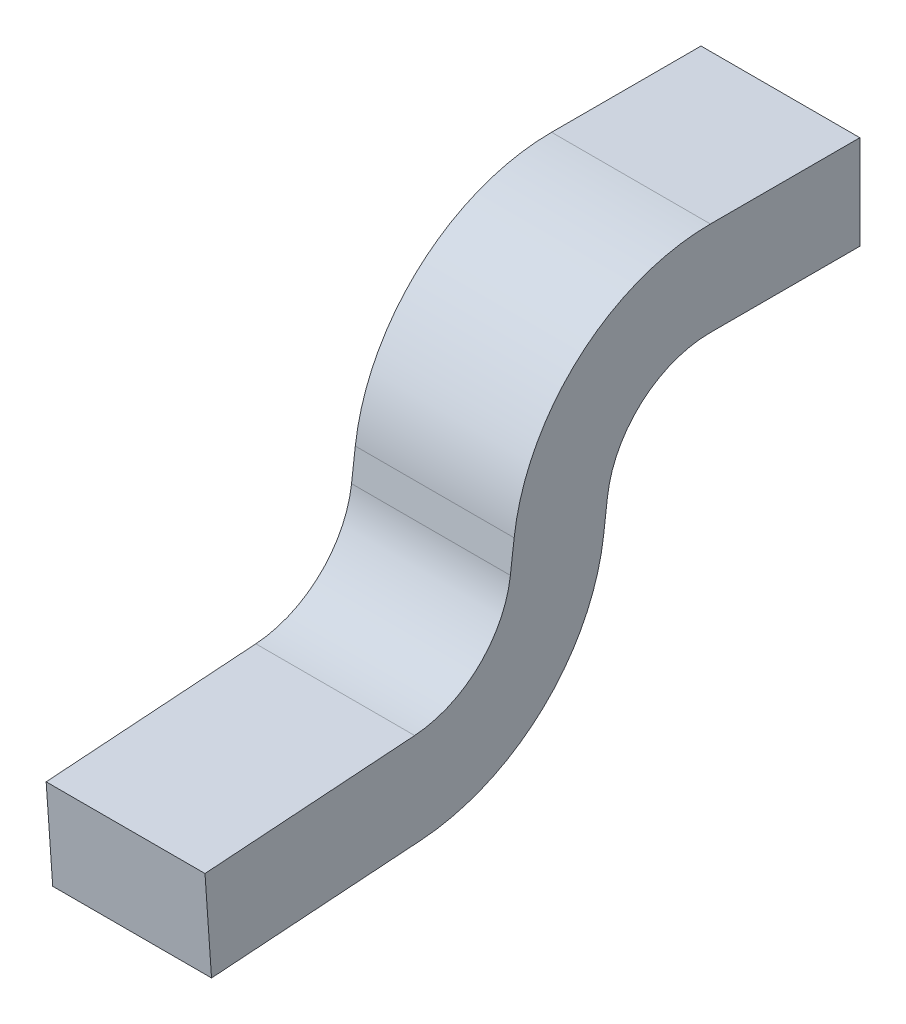
ISO-10303-21;
HEADER;
FILE_DESCRIPTION(('STEP AP214'),'2;1');
FILE_NAME('part.step','',(''),(''),'','','');
FILE_SCHEMA(('AUTOMOTIVE_DESIGN { 1 0 10303 214 1 1 1 1 }'));
ENDSEC;
DATA;
#1=APPLICATION_CONTEXT('core data for automotive mechanical design processes');
#2=APPLICATION_PROTOCOL_DEFINITION('international standard','automotive_design',2000,#1);
#3=PRODUCT_CONTEXT('',#1,'mechanical');
#4=PRODUCT('Part','Part','',(#3));
#5=PRODUCT_RELATED_PRODUCT_CATEGORY('part','',(#4));
#6=PRODUCT_DEFINITION_FORMATION('','',#4);
#7=PRODUCT_DEFINITION_CONTEXT('part definition',#1,'design');
#8=PRODUCT_DEFINITION('design','',#6,#7);
#9=PRODUCT_DEFINITION_SHAPE('','',#8);
#10=(LENGTH_UNIT() NAMED_UNIT(*) SI_UNIT(.MILLI.,.METRE.));
#11=(NAMED_UNIT(*) PLANE_ANGLE_UNIT() SI_UNIT($,.RADIAN.));
#12=(NAMED_UNIT(*) SI_UNIT($,.STERADIAN.) SOLID_ANGLE_UNIT());
#13=UNCERTAINTY_MEASURE_WITH_UNIT(LENGTH_MEASURE(1.E-05),#10,'distance_accuracy_value','');
#14=(GEOMETRIC_REPRESENTATION_CONTEXT(3) GLOBAL_UNCERTAINTY_ASSIGNED_CONTEXT((#13)) GLOBAL_UNIT_ASSIGNED_CONTEXT((#10,
#11,#12)) REPRESENTATION_CONTEXT('',''));
#15=CARTESIAN_POINT('',(0.,0.,0.));
#16=DIRECTION('',(0.,0.,1.));
#17=DIRECTION('',(1.,0.,0.));
#18=AXIS2_PLACEMENT_3D('',#15,#16,#17);
#19=CARTESIAN_POINT('',(0.1225,0.,0.));
#20=DIRECTION('',(1.,0.,0.));
#21=DIRECTION('',(0.,0.,-1.));
#22=AXIS2_PLACEMENT_3D('',#19,#20,#21);
#23=PLANE('',#22);
#24=CARTESIAN_POINT('',(0.1225,0.0675,-0.169489529934));
#25=DIRECTION('',(-1.,0.,0.));
#26=DIRECTION('',(0.,0.,1.));
#27=AXIS2_PLACEMENT_3D('',#24,#25,#26);
#28=CIRCLE('',#27,0.305);
#29=CARTESIAN_POINT('',(0.1225,0.104670149738761,0.133237046316236));
#30=VERTEX_POINT('',#29);
#31=CARTESIAN_POINT('',(0.1225,0.3725,-0.169489529934));
#32=VERTEX_POINT('',#31);
#33=EDGE_CURVE('E196',#30,#32,#28,.T.);
#34=ORIENTED_EDGE('',*,*,#33,.F.);
#35=DIRECTION('',(0.,-0.992546151641335,0.121869343405041));
#36=VECTOR('',#35,1.);
#37=CARTESIAN_POINT('',(0.1225,0.01767105479375,0.143919191988));
#38=LINE('',#37,#36);
#39=CARTESIAN_POINT('',(0.1225,0.0573739531898189,0.139044289042129));
#40=VERTEX_POINT('',#39);
#41=EDGE_CURVE('E193',#40,#30,#38,.F.);
#42=ORIENTED_EDGE('',*,*,#41,.F.);
#43=CARTESIAN_POINT('',(0.1225,0.07687304813464,0.297851673305));
#44=DIRECTION('',(1.,0.,0.));
#45=DIRECTION('',(0.,0.,-1.));
#46=AXIS2_PLACEMENT_3D('',#43,#44,#45);
#47=CIRCLE('',#46,0.16);
#48=CARTESIAN_POINT('',(0.1225,-0.082737199906957,0.286690637505469));
#49=VERTEX_POINT('',#48);
#50=EDGE_CURVE('E190',#40,#49,#47,.F.);
#51=ORIENTED_EDGE('',*,*,#50,.T.);
#52=DIRECTION('',(0.,-0.0697564737441177,0.997564050259825));
#53=VECTOR('',#52,1.);
#54=CARTESIAN_POINT('',(0.1225,-0.07353675199435,0.155118102495));
#55=LINE('',#54,#53);
#56=CARTESIAN_POINT('',(0.1225,-0.105353212712117,0.610114688692992));
#57=VERTEX_POINT('',#56);
#58=EDGE_CURVE('E186',#57,#49,#55,.F.);
#59=ORIENTED_EDGE('',*,*,#58,.F.);
#60=DIRECTION('',(0.,-0.997564050259825,-0.0697564737441078));
#61=VECTOR('',#60,1.);
#62=CARTESIAN_POINT('',(0.1225,-0.105353212712,0.610114688693));
#63=LINE('',#62,#61);
#64=CARTESIAN_POINT('',(0.1225,-0.250000000000002,0.600000000000027));
#65=VERTEX_POINT('',#64);
#66=EDGE_CURVE('E126',#65,#57,#63,.F.);
#67=ORIENTED_EDGE('',*,*,#66,.F.);
#68=DIRECTION('',(0.,0.0697564737441177,-0.997564050259825));
#69=VECTOR('',#68,1.);
#70=CARTESIAN_POINT('',(0.1225,-0.25,0.6));
#71=LINE('',#70,#69);
#72=CARTESIAN_POINT('',(0.1225,-0.227383987194625,0.276575948813034));
#73=VERTEX_POINT('',#72);
#74=EDGE_CURVE('E130',#73,#65,#71,.F.);
#75=ORIENTED_EDGE('',*,*,#74,.F.);
#76=CARTESIAN_POINT('',(0.1225,0.07687304813464,0.297851673305));
#77=DIRECTION('',(-1.,0.,0.));
#78=DIRECTION('',(0.,0.,1.));
#79=AXIS2_PLACEMENT_3D('',#76,#77,#78);
#80=CIRCLE('',#79,0.305);
#81=CARTESIAN_POINT('',(0.1225,0.0397028983960895,-0.00487490294584365));
#82=VERTEX_POINT('',#81);
#83=EDGE_CURVE('E174',#82,#73,#80,.T.);
#84=ORIENTED_EDGE('',*,*,#83,.F.);
#85=DIRECTION('',(0.,0.992546151641335,-0.121869343405041));
#86=VECTOR('',#85,1.);
#87=CARTESIAN_POINT('',(0.1225,-0.209845633361,0.02576580394965));
#88=LINE('',#87,#86);
#89=CARTESIAN_POINT('',(0.1225,0.0869990949448169,-0.0106821456715386));
#90=VERTEX_POINT('',#89);
#91=EDGE_CURVE('E90',#90,#82,#88,.F.);
#92=ORIENTED_EDGE('',*,*,#91,.F.);
#93=CARTESIAN_POINT('',(0.1225,0.0675,-0.169489529934));
#94=DIRECTION('',(1.,0.,0.));
#95=DIRECTION('',(0.,0.,-1.));
#96=AXIS2_PLACEMENT_3D('',#93,#94,#95);
#97=CIRCLE('',#96,0.16);
#98=CARTESIAN_POINT('',(0.1225,0.2275,-0.169489529934));
#99=VERTEX_POINT('',#98);
#100=EDGE_CURVE('E20',#90,#99,#97,.F.);
#101=ORIENTED_EDGE('',*,*,#100,.T.);
#102=DIRECTION('',(0.,0.,-1.));
#103=VECTOR('',#102,1.);
#104=CARTESIAN_POINT('',(0.1225,0.2275,-0.02793348760541));
#105=LINE('',#104,#103);
#106=CARTESIAN_POINT('',(0.1225,0.2275,-0.4));
#107=VERTEX_POINT('',#106);
#108=EDGE_CURVE('E96',#107,#99,#105,.F.);
#109=ORIENTED_EDGE('',*,*,#108,.F.);
#110=DIRECTION('',(0.,1.,0.));
#111=VECTOR('',#110,1.);
#112=CARTESIAN_POINT('',(0.1225,0.2275,-0.4));
#113=LINE('',#112,#111);
#114=CARTESIAN_POINT('',(0.1225,0.3725,-0.4));
#115=VERTEX_POINT('',#114);
#116=EDGE_CURVE('E102',#115,#107,#113,.F.);
#117=ORIENTED_EDGE('',*,*,#116,.F.);
#118=DIRECTION('',(0.,0.,1.));
#119=VECTOR('',#118,1.);
#120=CARTESIAN_POINT('',(0.1225,0.3725,-0.4));
#121=LINE('',#120,#119);
#122=EDGE_CURVE('E108',#32,#115,#121,.F.);
#123=ORIENTED_EDGE('',*,*,#122,.F.);
#124=EDGE_LOOP('',(#34,#42,#51,#59,#67,#75,#84,#92,#101,#109,#117,#123));
#125=FACE_BOUND('',#124,.T.);
#126=ADVANCED_FACE('F17',(#125),#23,.T.);
#127=CARTESIAN_POINT('',(-0.1225,-0.209845633361,0.02576580394965));
#128=DIRECTION('',(0.,-0.121869343405041,-0.992546151641335));
#129=DIRECTION('',(0.,0.992546151641335,-0.121869343405041));
#130=AXIS2_PLACEMENT_3D('',#127,#128,#129);
#131=PLANE('',#130);
#132=DIRECTION('',(1.,0.,0.));
#133=VECTOR('',#132,1.);
#134=CARTESIAN_POINT('',(-0.1225,0.0869990949448638,-0.0106821456713934));
#135=LINE('',#134,#133);
#136=CARTESIAN_POINT('',(-0.1225,0.0869990949448222,-0.0106821456715693));
#137=VERTEX_POINT('',#136);
#138=EDGE_CURVE('E211',#137,#90,#135,.T.);
#139=ORIENTED_EDGE('',*,*,#138,.T.);
#140=ORIENTED_EDGE('',*,*,#91,.T.);
#141=DIRECTION('',(-1.,0.,0.));
#142=VECTOR('',#141,1.);
#143=CARTESIAN_POINT('',(-0.1225,0.0397028983961342,-0.00487490294561111));
#144=LINE('',#143,#142);
#145=CARTESIAN_POINT('',(-0.1225,0.0397028983960692,-0.00487490294586855));
#146=VERTEX_POINT('',#145);
#147=EDGE_CURVE('E172',#146,#82,#144,.F.);
#148=ORIENTED_EDGE('',*,*,#147,.F.);
#149=DIRECTION('',(0.,0.992546151641321,-0.121869343405153));
#150=VECTOR('',#149,1.);
#151=CARTESIAN_POINT('',(-0.1225,0.03970289839607,-0.004874902946134));
#152=LINE('',#151,#150);
#153=EDGE_CURVE('E169',#146,#137,#152,.T.);
#154=ORIENTED_EDGE('',*,*,#153,.T.);
#155=EDGE_LOOP('',(#139,#140,#148,#154));
#156=FACE_BOUND('',#155,.T.);
#157=ADVANCED_FACE('F257',(#156),#131,.T.);
#158=CARTESIAN_POINT('',(-0.1225,0.0675,-0.169489529934));
#159=DIRECTION('',(1.,0.,0.));
#160=DIRECTION('',(0.,0.,-1.));
#161=AXIS2_PLACEMENT_3D('',#158,#159,#160);
#162=CYLINDRICAL_SURFACE('',#161,0.16);
#163=ORIENTED_EDGE('',*,*,#138,.F.);
#164=CARTESIAN_POINT('',(-0.1225,0.0675,-0.169489529934));
#165=DIRECTION('',(1.,0.,0.));
#166=DIRECTION('',(0.,0.,-1.));
#167=AXIS2_PLACEMENT_3D('',#164,#165,#166);
#168=CIRCLE('',#167,0.16);
#169=CARTESIAN_POINT('',(-0.1225,0.2275,-0.169489529934));
#170=VERTEX_POINT('',#169);
#171=EDGE_CURVE('E166',#137,#170,#168,.F.);
#172=ORIENTED_EDGE('',*,*,#171,.T.);
#173=DIRECTION('',(1.,0.,0.));
#174=VECTOR('',#173,1.);
#175=CARTESIAN_POINT('',(-0.1225,0.2275,-0.169489529934));
#176=LINE('',#175,#174);
#177=EDGE_CURVE('E209',#99,#170,#176,.F.);
#178=ORIENTED_EDGE('',*,*,#177,.F.);
#179=ORIENTED_EDGE('',*,*,#100,.F.);
#180=EDGE_LOOP('',(#163,#172,#178,#179));
#181=FACE_BOUND('',#180,.T.);
#182=ADVANCED_FACE('F255',(#181),#162,.F.);
#183=CARTESIAN_POINT('',(-0.1225,0.2275,-0.02793348760541));
#184=DIRECTION('',(0.,-1.,0.));
#185=DIRECTION('',(0.,0.,-1.));
#186=AXIS2_PLACEMENT_3D('',#183,#184,#185);
#187=PLANE('',#186);
#188=ORIENTED_EDGE('',*,*,#177,.T.);
#189=DIRECTION('',(0.,0.,-1.));
#190=VECTOR('',#189,1.);
#191=CARTESIAN_POINT('',(-0.1225,0.2275,0.));
#192=LINE('',#191,#190);
#193=CARTESIAN_POINT('',(-0.1225,0.2275,-0.4));
#194=VERTEX_POINT('',#193);
#195=EDGE_CURVE('E163',#170,#194,#192,.T.);
#196=ORIENTED_EDGE('',*,*,#195,.T.);
#197=DIRECTION('',(-1.,0.,0.));
#198=VECTOR('',#197,1.);
#199=CARTESIAN_POINT('',(-0.1225,0.2275,-0.4));
#200=LINE('',#199,#198);
#201=EDGE_CURVE('E205',#107,#194,#200,.T.);
#202=ORIENTED_EDGE('',*,*,#201,.F.);
#203=ORIENTED_EDGE('',*,*,#108,.T.);
#204=EDGE_LOOP('',(#188,#196,#202,#203));
#205=FACE_BOUND('',#204,.T.);
#206=ADVANCED_FACE('F251',(#205),#187,.T.);
#207=CARTESIAN_POINT('',(-0.1225,0.2275,-0.4));
#208=DIRECTION('',(0.,0.,-1.));
#209=DIRECTION('',(-1.,0.,0.));
#210=AXIS2_PLACEMENT_3D('',#207,#208,#209);
#211=PLANE('',#210);
#212=ORIENTED_EDGE('',*,*,#201,.T.);
#213=DIRECTION('',(0.,1.,0.));
#214=VECTOR('',#213,1.);
#215=CARTESIAN_POINT('',(-0.1225,0.,-0.4));
#216=LINE('',#215,#214);
#217=CARTESIAN_POINT('',(-0.1225,0.3725,-0.4));
#218=VERTEX_POINT('',#217);
#219=EDGE_CURVE('E160',#194,#218,#216,.T.);
#220=ORIENTED_EDGE('',*,*,#219,.T.);
#221=DIRECTION('',(1.,0.,0.));
#222=VECTOR('',#221,1.);
#223=CARTESIAN_POINT('',(-0.1225,0.3725,-0.4));
#224=LINE('',#223,#222);
#225=EDGE_CURVE('E197',#115,#218,#224,.F.);
#226=ORIENTED_EDGE('',*,*,#225,.F.);
#227=ORIENTED_EDGE('',*,*,#116,.T.);
#228=EDGE_LOOP('',(#212,#220,#226,#227));
#229=FACE_BOUND('',#228,.T.);
#230=ADVANCED_FACE('F250',(#229),#211,.T.);
#231=CARTESIAN_POINT('',(-0.1225,0.3725,-0.4));
#232=DIRECTION('',(0.,1.,0.));
#233=DIRECTION('',(0.,0.,1.));
#234=AXIS2_PLACEMENT_3D('',#231,#232,#233);
#235=PLANE('',#234);
#236=ORIENTED_EDGE('',*,*,#225,.T.);
#237=DIRECTION('',(0.,0.,-1.));
#238=VECTOR('',#237,1.);
#239=CARTESIAN_POINT('',(-0.1225,0.3725,0.));
#240=LINE('',#239,#238);
#241=CARTESIAN_POINT('',(-0.1225,0.3725,-0.169489529934));
#242=VERTEX_POINT('',#241);
#243=EDGE_CURVE('E157',#218,#242,#240,.F.);
#244=ORIENTED_EDGE('',*,*,#243,.T.);
#245=DIRECTION('',(-1.,0.,0.));
#246=VECTOR('',#245,1.);
#247=CARTESIAN_POINT('',(-0.1225,0.3725,-0.169489529934));
#248=LINE('',#247,#246);
#249=EDGE_CURVE('E194',#32,#242,#248,.T.);
#250=ORIENTED_EDGE('',*,*,#249,.F.);
#251=ORIENTED_EDGE('',*,*,#122,.T.);
#252=EDGE_LOOP('',(#236,#244,#250,#251));
#253=FACE_BOUND('',#252,.T.);
#254=ADVANCED_FACE('F245',(#253),#235,.T.);
#255=CARTESIAN_POINT('',(-0.1225,0.0675,-0.169489529934));
#256=DIRECTION('',(-1.,0.,0.));
#257=DIRECTION('',(0.,0.,1.));
#258=AXIS2_PLACEMENT_3D('',#255,#256,#257);
#259=CYLINDRICAL_SURFACE('',#258,0.305);
#260=CARTESIAN_POINT('',(-0.1225,0.0675,-0.169489529934));
#261=DIRECTION('',(-1.,0.,0.));
#262=DIRECTION('',(0.,0.,1.));
#263=AXIS2_PLACEMENT_3D('',#260,#261,#262);
#264=CIRCLE('',#263,0.305);
#265=CARTESIAN_POINT('',(-0.1225,0.104670149739809,0.133237046316004));
#266=VERTEX_POINT('',#265);
#267=EDGE_CURVE('E156',#242,#266,#264,.F.);
#268=ORIENTED_EDGE('',*,*,#267,.T.);
#269=DIRECTION('',(1.,0.,0.));
#270=VECTOR('',#269,1.);
#271=CARTESIAN_POINT('',(-0.1225,0.104670149739025,0.133237046316204));
#272=LINE('',#271,#270);
#273=EDGE_CURVE('E191',#30,#266,#272,.F.);
#274=ORIENTED_EDGE('',*,*,#273,.F.);
#275=ORIENTED_EDGE('',*,*,#33,.T.);
#276=ORIENTED_EDGE('',*,*,#249,.T.);
#277=EDGE_LOOP('',(#268,#274,#275,#276));
#278=FACE_BOUND('',#277,.T.);
#279=ADVANCED_FACE('F243',(#278),#259,.T.);
#280=CARTESIAN_POINT('',(-0.1225,0.01767105479375,0.143919191988));
#281=DIRECTION('',(0.,0.121869343405041,0.992546151641335));
#282=DIRECTION('',(0.,-0.992546151641335,0.121869343405041));
#283=AXIS2_PLACEMENT_3D('',#280,#281,#282);
#284=PLANE('',#283);
#285=ORIENTED_EDGE('',*,*,#273,.T.);
#286=DIRECTION('',(0.,-0.992546151640481,0.121869343412));
#287=VECTOR('',#286,1.);
#288=CARTESIAN_POINT('',(-0.1225,0.104670149739,0.133237046316));
#289=LINE('',#288,#287);
#290=CARTESIAN_POINT('',(-0.1225,0.05737395318927,0.139044289042262));
#291=VERTEX_POINT('',#290);
#292=EDGE_CURVE('E146',#266,#291,#289,.T.);
#293=ORIENTED_EDGE('',*,*,#292,.T.);
#294=DIRECTION('',(1.,0.,0.));
#295=VECTOR('',#294,1.);
#296=CARTESIAN_POINT('',(-0.1225,0.057373953189867,0.139044289042382));
#297=LINE('',#296,#295);
#298=EDGE_CURVE('E187',#291,#40,#297,.T.);
#299=ORIENTED_EDGE('',*,*,#298,.T.);
#300=ORIENTED_EDGE('',*,*,#41,.T.);
#301=EDGE_LOOP('',(#285,#293,#299,#300));
#302=FACE_BOUND('',#301,.T.);
#303=ADVANCED_FACE('F266',(#302),#284,.T.);
#304=CARTESIAN_POINT('',(-0.1225,0.07687304813464,0.297851673305));
#305=DIRECTION('',(1.,0.,0.));
#306=DIRECTION('',(0.,0.,-1.));
#307=AXIS2_PLACEMENT_3D('',#304,#305,#306);
#308=CYLINDRICAL_SURFACE('',#307,0.16);
#309=ORIENTED_EDGE('',*,*,#298,.F.);
#310=CARTESIAN_POINT('',(-0.1225,0.07687304813464,0.297851673305));
#311=DIRECTION('',(1.,0.,0.));
#312=DIRECTION('',(0.,0.,-1.));
#313=AXIS2_PLACEMENT_3D('',#310,#311,#312);
#314=CIRCLE('',#313,0.16);
#315=CARTESIAN_POINT('',(-0.1225,-0.082737199906966,0.286690637505557));
#316=VERTEX_POINT('',#315);
#317=EDGE_CURVE('E144',#291,#316,#314,.F.);
#318=ORIENTED_EDGE('',*,*,#317,.T.);
#319=DIRECTION('',(1.,0.,0.));
#320=VECTOR('',#319,1.);
#321=CARTESIAN_POINT('',(-0.1225,-0.0827371999069242,0.286690637505));
#322=LINE('',#321,#320);
#323=EDGE_CURVE('E143',#49,#316,#322,.F.);
#324=ORIENTED_EDGE('',*,*,#323,.F.);
#325=ORIENTED_EDGE('',*,*,#50,.F.);
#326=EDGE_LOOP('',(#309,#318,#324,#325));
#327=FACE_BOUND('',#326,.T.);
#328=ADVANCED_FACE('F264',(#327),#308,.F.);
#329=CARTESIAN_POINT('',(-0.1225,-0.07353675199435,0.155118102495));
#330=DIRECTION('',(0.,0.997564050259825,0.0697564737441177));
#331=DIRECTION('',(0.,-0.0697564737441177,0.997564050259825));
#332=AXIS2_PLACEMENT_3D('',#329,#330,#331);
#333=PLANE('',#332);
#334=ORIENTED_EDGE('',*,*,#323,.T.);
#335=DIRECTION('',(0.,-0.0697564737430156,0.997564050259902));
#336=VECTOR('',#335,1.);
#337=CARTESIAN_POINT('',(-0.1225,-0.08273719990693,0.286690637505));
#338=LINE('',#337,#336);
#339=CARTESIAN_POINT('',(-0.1225,-0.105353212712,0.610114688693));
#340=VERTEX_POINT('',#339);
#341=EDGE_CURVE('E137',#316,#340,#338,.T.);
#342=ORIENTED_EDGE('',*,*,#341,.T.);
#343=DIRECTION('',(1.,0.,0.));
#344=VECTOR('',#343,1.);
#345=CARTESIAN_POINT('',(-0.1225,-0.105353212712,0.610114688693));
#346=LINE('',#345,#344);
#347=EDGE_CURVE('E120',#57,#340,#346,.F.);
#348=ORIENTED_EDGE('',*,*,#347,.F.);
#349=ORIENTED_EDGE('',*,*,#58,.T.);
#350=EDGE_LOOP('',(#334,#342,#348,#349));
#351=FACE_BOUND('',#350,.T.);
#352=ADVANCED_FACE('F141',(#351),#333,.T.);
#353=CARTESIAN_POINT('',(-0.1225,-0.105353212712,0.610114688693));
#354=DIRECTION('',(0.,-0.0697564737441078,0.997564050259826));
#355=DIRECTION('',(0.,-0.997564050259825,-0.0697564737441078));
#356=AXIS2_PLACEMENT_3D('',#353,#354,#355);
#357=PLANE('',#356);
#358=ORIENTED_EDGE('',*,*,#347,.T.);
#359=DIRECTION('',(0.,-0.997564050259786,-0.0697564737446684));
#360=VECTOR('',#359,1.);
#361=CARTESIAN_POINT('',(-0.1225,-0.105353212712,0.610114688693));
#362=LINE('',#361,#360);
#363=CARTESIAN_POINT('',(-0.1225,-0.25,0.6));
#364=VERTEX_POINT('',#363);
#365=EDGE_CURVE('E124',#340,#364,#362,.T.);
#366=ORIENTED_EDGE('',*,*,#365,.T.);
#367=DIRECTION('',(1.,0.,0.));
#368=VECTOR('',#367,1.);
#369=CARTESIAN_POINT('',(-0.1225,-0.25,0.6));
#370=LINE('',#369,#368);
#371=EDGE_CURVE('E177',#65,#364,#370,.F.);
#372=ORIENTED_EDGE('',*,*,#371,.F.);
#373=ORIENTED_EDGE('',*,*,#66,.T.);
#374=EDGE_LOOP('',(#358,#366,#372,#373));
#375=FACE_BOUND('',#374,.T.);
#376=ADVANCED_FACE('F122',(#375),#357,.T.);
#377=CARTESIAN_POINT('',(-0.1225,-0.25,0.6));
#378=DIRECTION('',(0.,-0.997564050259825,-0.0697564737441177));
#379=DIRECTION('',(0.,0.0697564737441177,-0.997564050259825));
#380=AXIS2_PLACEMENT_3D('',#377,#378,#379);
#381=PLANE('',#380);
#382=ORIENTED_EDGE('',*,*,#371,.T.);
#383=DIRECTION('',(0.,0.0697564737430153,-0.997564050259902));
#384=VECTOR('',#383,1.);
#385=CARTESIAN_POINT('',(-0.1225,-0.25,0.6));
#386=LINE('',#385,#384);
#387=CARTESIAN_POINT('',(-0.1225,-0.227383987194815,0.27657594881319));
#388=VERTEX_POINT('',#387);
#389=EDGE_CURVE('E26',#364,#388,#386,.T.);
#390=ORIENTED_EDGE('',*,*,#389,.T.);
#391=DIRECTION('',(-1.,0.,0.));
#392=VECTOR('',#391,1.);
#393=CARTESIAN_POINT('',(-0.1225,-0.227383987194605,0.276575948813027));
#394=LINE('',#393,#392);
#395=EDGE_CURVE('E34',#73,#388,#394,.T.);
#396=ORIENTED_EDGE('',*,*,#395,.F.);
#397=ORIENTED_EDGE('',*,*,#74,.T.);
#398=EDGE_LOOP('',(#382,#390,#396,#397));
#399=FACE_BOUND('',#398,.T.);
#400=ADVANCED_FACE('F260',(#399),#381,.T.);
#401=CARTESIAN_POINT('',(-0.1225,0.07687304813464,0.297851673305));
#402=DIRECTION('',(-1.,0.,0.));
#403=DIRECTION('',(0.,0.,1.));
#404=AXIS2_PLACEMENT_3D('',#401,#402,#403);
#405=CYLINDRICAL_SURFACE('',#404,0.305);
#406=CARTESIAN_POINT('',(-0.1225,0.07687304813464,0.297851673305));
#407=DIRECTION('',(-1.,0.,0.));
#408=DIRECTION('',(0.,0.,1.));
#409=AXIS2_PLACEMENT_3D('',#406,#407,#408);
#410=CIRCLE('',#409,0.305);
#411=EDGE_CURVE('E11',#388,#146,#410,.F.);
#412=ORIENTED_EDGE('',*,*,#411,.T.);
#413=ORIENTED_EDGE('',*,*,#147,.T.);
#414=ORIENTED_EDGE('',*,*,#83,.T.);
#415=ORIENTED_EDGE('',*,*,#395,.T.);
#416=EDGE_LOOP('',(#412,#413,#414,#415));
#417=FACE_BOUND('',#416,.T.);
#418=ADVANCED_FACE('F277',(#417),#405,.T.);
#419=CARTESIAN_POINT('',(-0.1225,0.,0.));
#420=DIRECTION('',(1.,0.,0.));
#421=DIRECTION('',(0.,0.,-1.));
#422=AXIS2_PLACEMENT_3D('',#419,#420,#421);
#423=PLANE('',#422);
#424=ORIENTED_EDGE('',*,*,#389,.F.);
#425=ORIENTED_EDGE('',*,*,#365,.F.);
#426=ORIENTED_EDGE('',*,*,#341,.F.);
#427=ORIENTED_EDGE('',*,*,#317,.F.);
#428=ORIENTED_EDGE('',*,*,#292,.F.);
#429=ORIENTED_EDGE('',*,*,#267,.F.);
#430=ORIENTED_EDGE('',*,*,#243,.F.);
#431=ORIENTED_EDGE('',*,*,#219,.F.);
#432=ORIENTED_EDGE('',*,*,#195,.F.);
#433=ORIENTED_EDGE('',*,*,#171,.F.);
#434=ORIENTED_EDGE('',*,*,#153,.F.);
#435=ORIENTED_EDGE('',*,*,#411,.F.);
#436=EDGE_LOOP('',(#424,#425,#426,#427,#428,#429,#430,#431,#432,#433,#434,#435));
#437=FACE_BOUND('',#436,.T.);
#438=ADVANCED_FACE('F135',(#437),#423,.F.);
#439=CLOSED_SHELL('',(#126,#157,#182,#206,#230,#254,#279,#303,#328,#352,#376,#400,#418,#438));
#440=MANIFOLD_SOLID_BREP('B1',#439);
#441=ADVANCED_BREP_SHAPE_REPRESENTATION('',(#18,#440),#14);
#442=SHAPE_DEFINITION_REPRESENTATION(#9,#441);
ENDSEC;
END-ISO-10303-21;
